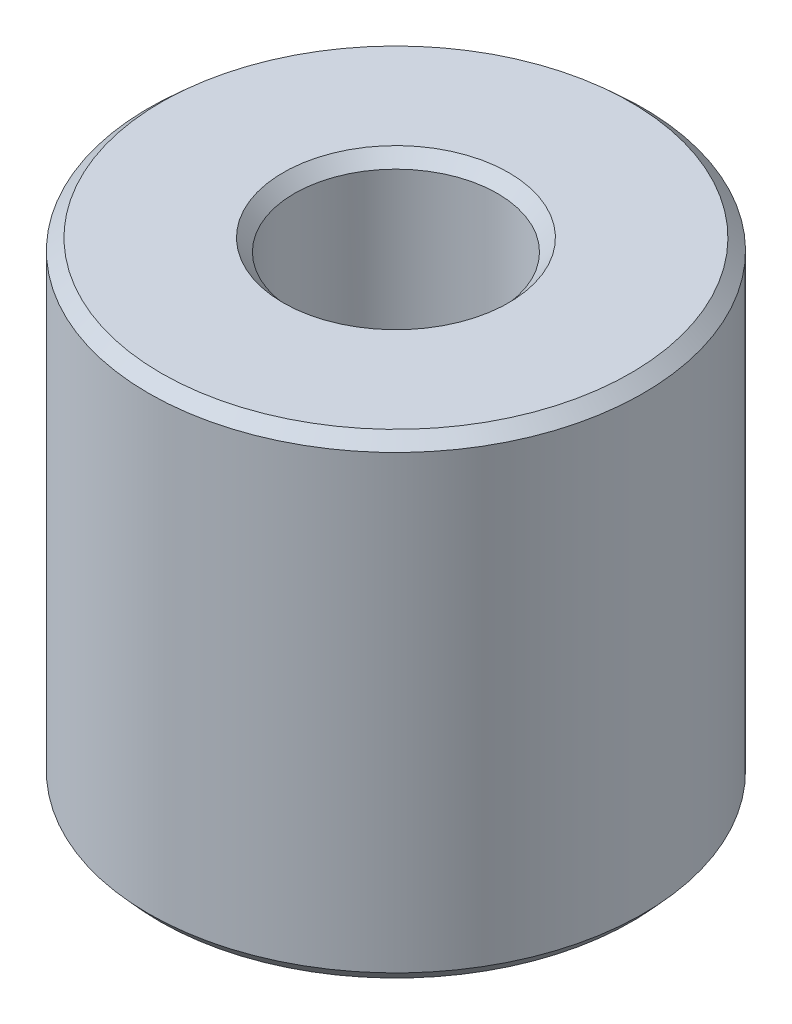
ISO-10303-21;
HEADER;
FILE_DESCRIPTION(('STEP AP214'),'2;1');
FILE_NAME('part.step','',(''),(''),'','','');
FILE_SCHEMA(('AUTOMOTIVE_DESIGN { 1 0 10303 214 1 1 1 1 }'));
ENDSEC;
DATA;
#1=APPLICATION_CONTEXT('core data for automotive mechanical design processes');
#2=APPLICATION_PROTOCOL_DEFINITION('international standard','automotive_design',2000,#1);
#3=PRODUCT_CONTEXT('',#1,'mechanical');
#4=PRODUCT('Part','Part','',(#3));
#5=PRODUCT_RELATED_PRODUCT_CATEGORY('part','',(#4));
#6=PRODUCT_DEFINITION_FORMATION('','',#4);
#7=PRODUCT_DEFINITION_CONTEXT('part definition',#1,'design');
#8=PRODUCT_DEFINITION('design','',#6,#7);
#9=PRODUCT_DEFINITION_SHAPE('','',#8);
#10=(LENGTH_UNIT() NAMED_UNIT(*) SI_UNIT(.MILLI.,.METRE.));
#11=(NAMED_UNIT(*) PLANE_ANGLE_UNIT() SI_UNIT($,.RADIAN.));
#12=(NAMED_UNIT(*) SI_UNIT($,.STERADIAN.) SOLID_ANGLE_UNIT());
#13=UNCERTAINTY_MEASURE_WITH_UNIT(LENGTH_MEASURE(1.E-05),#10,'distance_accuracy_value','');
#14=(GEOMETRIC_REPRESENTATION_CONTEXT(3) GLOBAL_UNCERTAINTY_ASSIGNED_CONTEXT((#13)) GLOBAL_UNIT_ASSIGNED_CONTEXT((#10,
#11,#12)) REPRESENTATION_CONTEXT('',''));
#15=CARTESIAN_POINT('',(0.,0.,0.));
#16=DIRECTION('',(0.,0.,1.));
#17=DIRECTION('',(1.,0.,0.));
#18=AXIS2_PLACEMENT_3D('',#15,#16,#17);
#19=CARTESIAN_POINT('',(0.,110.350583465729,0.));
#20=DIRECTION('',(0.,-1.,0.));
#21=DIRECTION('',(0.,0.,-1.));
#22=AXIS2_PLACEMENT_3D('',#19,#20,#21);
#23=CYLINDRICAL_SURFACE('',#22,57.5);
#24=CARTESIAN_POINT('',(0.,2.88990004348269,0.));
#25=DIRECTION('',(0.,1.,0.));
#26=DIRECTION('',(0.,0.,1.));
#27=AXIS2_PLACEMENT_3D('',#24,#25,#26);
#28=CIRCLE('',#27,57.5);
#29=CARTESIAN_POINT('',(0.,2.88990004348269,57.5));
#30=VERTEX_POINT('',#29);
#31=EDGE_CURVE('E10',#30,#30,#28,.T.);
#32=ORIENTED_EDGE('',*,*,#31,.T.);
#33=EDGE_LOOP('',(#32));
#34=FACE_BOUND('',#33,.T.);
#35=CARTESIAN_POINT('',(0.,107.729197914453,0.));
#36=DIRECTION('',(0.,1.,0.));
#37=DIRECTION('',(0.,0.,1.));
#38=AXIS2_PLACEMENT_3D('',#35,#36,#37);
#39=CIRCLE('',#38,57.5);
#40=CARTESIAN_POINT('',(0.,107.729197914453,57.5));
#41=VERTEX_POINT('',#40);
#42=EDGE_CURVE('E50',#41,#41,#39,.F.);
#43=ORIENTED_EDGE('',*,*,#42,.T.);
#44=EDGE_LOOP('',(#43));
#45=FACE_BOUND('',#44,.T.);
#46=ADVANCED_FACE('F39',(#34,#45),#23,.T.);
#47=CARTESIAN_POINT('',(0.,110.350583465729,0.));
#48=DIRECTION('',(0.,1.,0.));
#49=DIRECTION('',(0.,0.,1.));
#50=AXIS2_PLACEMENT_3D('',#47,#48,#49);
#51=PLANE('',#50);
#52=CARTESIAN_POINT('',(0.,110.350583465729,0.));
#53=DIRECTION('',(0.,1.,0.));
#54=DIRECTION('',(0.,0.,1.));
#55=AXIS2_PLACEMENT_3D('',#52,#53,#54);
#56=CIRCLE('',#55,26.2375883471328);
#57=CARTESIAN_POINT('',(0.,110.350583465729,26.2375883471328));
#58=VERTEX_POINT('',#57);
#59=EDGE_CURVE('E58',#58,#58,#56,.F.);
#60=ORIENTED_EDGE('',*,*,#59,.T.);
#61=EDGE_LOOP('',(#60));
#62=FACE_BOUND('',#61,.T.);
#63=CARTESIAN_POINT('',(0.,110.350583465729,0.));
#64=DIRECTION('',(0.,1.,0.));
#65=DIRECTION('',(0.,0.,1.));
#66=AXIS2_PLACEMENT_3D('',#63,#64,#65);
#67=CIRCLE('',#66,54.6100999565173);
#68=CARTESIAN_POINT('',(0.,110.350583465729,54.6100999565173));
#69=VERTEX_POINT('',#68);
#70=EDGE_CURVE('E61',#69,#69,#67,.T.);
#71=ORIENTED_EDGE('',*,*,#70,.T.);
#72=EDGE_LOOP('',(#71));
#73=FACE_BOUND('',#72,.T.);
#74=ADVANCED_FACE('F88',(#62,#73),#51,.T.);
#75=CARTESIAN_POINT('',(0.,0.,0.));
#76=DIRECTION('',(0.,1.,0.));
#77=DIRECTION('',(0.,0.,1.));
#78=AXIS2_PLACEMENT_3D('',#75,#76,#77);
#79=PLANE('',#78);
#80=CARTESIAN_POINT('',(0.,0.,0.));
#81=DIRECTION('',(0.,1.,0.));
#82=DIRECTION('',(0.,0.,1.));
#83=AXIS2_PLACEMENT_3D('',#80,#81,#82);
#84=CIRCLE('',#83,26.506102839339);
#85=CARTESIAN_POINT('',(0.,0.,-26.506102839339));
#86=VERTEX_POINT('',#85);
#87=EDGE_CURVE('E51',#86,#86,#84,.T.);
#88=ORIENTED_EDGE('',*,*,#87,.T.);
#89=EDGE_LOOP('',(#88));
#90=FACE_BOUND('',#89,.T.);
#91=CARTESIAN_POINT('',(0.,0.,0.));
#92=DIRECTION('',(0.,1.,0.));
#93=DIRECTION('',(0.,0.,1.));
#94=AXIS2_PLACEMENT_3D('',#91,#92,#93);
#95=CIRCLE('',#94,54.8786144487235);
#96=CARTESIAN_POINT('',(0.,0.,54.8786144487235));
#97=VERTEX_POINT('',#96);
#98=EDGE_CURVE('E54',#97,#97,#95,.F.);
#99=ORIENTED_EDGE('',*,*,#98,.T.);
#100=EDGE_LOOP('',(#99));
#101=FACE_BOUND('',#100,.T.);
#102=ADVANCED_FACE('F83',(#90,#101),#79,.F.);
#103=CARTESIAN_POINT('',(0.,110.350583465729,0.));
#104=DIRECTION('',(0.,-1.,0.));
#105=DIRECTION('',(0.,0.,-1.));
#106=AXIS2_PLACEMENT_3D('',#103,#104,#105);
#107=CYLINDRICAL_SURFACE('',#106,23.6162027958563);
#108=CARTESIAN_POINT('',(0.,107.460683422247,0.));
#109=DIRECTION('',(0.,1.,0.));
#110=DIRECTION('',(0.,0.,1.));
#111=AXIS2_PLACEMENT_3D('',#108,#109,#110);
#112=CIRCLE('',#111,23.6162027958563);
#113=CARTESIAN_POINT('',(0.,107.460683422247,23.6162027958563));
#114=VERTEX_POINT('',#113);
#115=EDGE_CURVE('E67',#114,#114,#112,.T.);
#116=ORIENTED_EDGE('',*,*,#115,.T.);
#117=EDGE_LOOP('',(#116));
#118=FACE_BOUND('',#117,.T.);
#119=CARTESIAN_POINT('',(0.,2.62138555127651,0.));
#120=DIRECTION('',(0.,1.,0.));
#121=DIRECTION('',(0.,0.,1.));
#122=AXIS2_PLACEMENT_3D('',#119,#120,#121);
#123=CIRCLE('',#122,23.6162027958563);
#124=CARTESIAN_POINT('',(0.,2.62138555127651,-23.6162027958563));
#125=VERTEX_POINT('',#124);
#126=EDGE_CURVE('E69',#125,#125,#123,.F.);
#127=ORIENTED_EDGE('',*,*,#126,.T.);
#128=EDGE_LOOP('',(#127));
#129=FACE_BOUND('',#128,.T.);
#130=ADVANCED_FACE('F71',(#118,#129),#107,.F.);
#131=CARTESIAN_POINT('',(0.,107.460683422247,0.));
#132=DIRECTION('',(0.,1.,0.));
#133=DIRECTION('',(0.,0.,1.));
#134=AXIS2_PLACEMENT_3D('',#131,#132,#133);
#135=CONICAL_SURFACE('',#134,23.6162027958563,0.736715813299954);
#136=ORIENTED_EDGE('',*,*,#59,.F.);
#137=EDGE_LOOP('',(#136));
#138=FACE_BOUND('',#137,.T.);
#139=ORIENTED_EDGE('',*,*,#115,.F.);
#140=EDGE_LOOP('',(#139));
#141=FACE_BOUND('',#140,.T.);
#142=ADVANCED_FACE('F77',(#138,#141),#135,.F.);
#143=CARTESIAN_POINT('',(0.,0.,0.));
#144=DIRECTION('',(0.,-1.,0.));
#145=DIRECTION('',(0.,0.,-1.));
#146=AXIS2_PLACEMENT_3D('',#143,#144,#145);
#147=CONICAL_SURFACE('',#146,26.506102839339,0.834080513494946);
#148=CARTESIAN_POINT('',(0.,2.62138555127651,-23.6162027958563));
#149=CARTESIAN_POINT('',(0.,2.59407945178405,-23.6463059213092));
#150=CARTESIAN_POINT('',(0.,2.56677335229159,-23.6764090467621));
#151=CARTESIAN_POINT('',(0.,2.51216115330666,-23.736615297668));
#152=CARTESIAN_POINT('',(0.,2.48485505381419,-23.766718423121));
#153=CARTESIAN_POINT('',(0.,2.43024285482927,-23.8269246740269));
#154=CARTESIAN_POINT('',(0.,2.4029367553368,-23.8570277994798));
#155=CARTESIAN_POINT('',(0.,2.34832455635188,-23.9172340503857));
#156=CARTESIAN_POINT('',(0.,2.32101845685941,-23.9473371758386));
#157=CARTESIAN_POINT('',(0.,2.26640625787449,-24.0075434267445));
#158=CARTESIAN_POINT('',(0.,2.23910015838202,-24.0376465521975));
#159=CARTESIAN_POINT('',(0.,2.18448795939709,-24.0978528031034));
#160=CARTESIAN_POINT('',(0.,2.15718185990463,-24.1279559285563));
#161=CARTESIAN_POINT('',(0.,2.1025696609197,-24.1881621794622));
#162=CARTESIAN_POINT('',(0.,2.07526356142724,-24.2182653049151));
#163=CARTESIAN_POINT('',(0.,2.02065136244231,-24.278471555821));
#164=CARTESIAN_POINT('',(0.,1.99334526294985,-24.308574681274));
#165=CARTESIAN_POINT('',(0.,1.93873306396492,-24.3687809321799));
#166=CARTESIAN_POINT('',(0.,1.91142696447246,-24.3988840576328));
#167=CARTESIAN_POINT('',(0.,1.85681476548753,-24.4590903085387));
#168=CARTESIAN_POINT('',(0.,1.82950866599507,-24.4891934339917));
#169=CARTESIAN_POINT('',(0.,1.77489646701014,-24.5493996848975));
#170=CARTESIAN_POINT('',(0.,1.74759036751768,-24.5795028103505));
#171=CARTESIAN_POINT('',(0.,1.69297816853275,-24.6397090612564));
#172=CARTESIAN_POINT('',(0.,1.66567206904029,-24.6698121867093));
#173=CARTESIAN_POINT('',(0.,1.61105987005536,-24.7300184376152));
#174=CARTESIAN_POINT('',(0.,1.58375377056289,-24.7601215630682));
#175=CARTESIAN_POINT('',(0.,1.52914157157797,-24.820327813974));
#176=CARTESIAN_POINT('',(0.,1.5018354720855,-24.850430939427));
#177=CARTESIAN_POINT('',(0.,1.44722327310058,-24.9106371903329));
#178=CARTESIAN_POINT('',(0.,1.41991717360811,-24.9407403157858));
#179=CARTESIAN_POINT('',(0.,1.36530497462318,-25.0009465666917));
#180=CARTESIAN_POINT('',(0.,1.33799887513072,-25.0310496921447));
#181=CARTESIAN_POINT('',(0.,1.28338667614579,-25.0912559430505));
#182=CARTESIAN_POINT('',(0.,1.25608057665333,-25.1213590685035));
#183=CARTESIAN_POINT('',(0.,1.2014683776684,-25.1815653194094));
#184=CARTESIAN_POINT('',(0.,1.17416227817594,-25.2116684448623));
#185=CARTESIAN_POINT('',(0.,1.11955007919101,-25.2718746957682));
#186=CARTESIAN_POINT('',(0.,1.09224397969855,-25.3019778212212));
#187=CARTESIAN_POINT('',(0.,1.03763178071362,-25.362184072127));
#188=CARTESIAN_POINT('',(0.,1.01032568122116,-25.39228719758));
#189=CARTESIAN_POINT('',(0.,0.955713482236229,-25.4524934484859));
#190=CARTESIAN_POINT('',(0.,0.928407382743766,-25.4825965739388));
#191=CARTESIAN_POINT('',(0.,0.873795183758838,-25.5428028248447));
#192=CARTESIAN_POINT('',(0.,0.846489084266374,-25.5729059502977));
#193=CARTESIAN_POINT('',(0.,0.791876885281447,-25.6331122012035));
#194=CARTESIAN_POINT('',(0.,0.764570785788983,-25.6632153266565));
#195=CARTESIAN_POINT('',(0.,0.709958586804056,-25.7234215775624));
#196=CARTESIAN_POINT('',(0.,0.682652487311592,-25.7535247030153));
#197=CARTESIAN_POINT('',(0.,0.628040288326665,-25.8137309539212));
#198=CARTESIAN_POINT('',(0.,0.600734188834201,-25.8438340793742));
#199=CARTESIAN_POINT('',(0.,0.546121989849274,-25.9040403302801));
#200=CARTESIAN_POINT('',(0.,0.51881589035681,-25.934143455733));
#201=CARTESIAN_POINT('',(0.,0.464203691371882,-25.9943497066389));
#202=CARTESIAN_POINT('',(0.,0.436897591879419,-26.0244528320918));
#203=CARTESIAN_POINT('',(0.,0.382285392894491,-26.0846590829977));
#204=CARTESIAN_POINT('',(0.,0.354979293402028,-26.1147622084507));
#205=CARTESIAN_POINT('',(0.,0.300367094417101,-26.1749684593566));
#206=CARTESIAN_POINT('',(0.,0.273060994924637,-26.2050715848095));
#207=CARTESIAN_POINT('',(0.,0.218448795939709,-26.2652778357154));
#208=CARTESIAN_POINT('',(0.,0.191142696447245,-26.2953809611683));
#209=CARTESIAN_POINT('',(0.,0.136530497462318,-26.3555872120742));
#210=CARTESIAN_POINT('',(0.,0.109224397969855,-26.3856903375272));
#211=CARTESIAN_POINT('',(0.,0.0546121989849279,-26.4458965884331));
#212=CARTESIAN_POINT('',(0.,0.0273060994924645,-26.475999713886));
#213=CARTESIAN_POINT('',(0.,0.,-26.506102839339));
#214=B_SPLINE_CURVE_WITH_KNOTS('',3,(#148,#149,#150,#151,#152,#153,#154,#155,#156,#157,#158,
#159,#160,#161,#162,#163,#164,#165,#166,#167,#168,#169,#170,#171,#172,#173,#174,#175,#176,#177,
#178,#179,#180,#181,#182,#183,#184,#185,#186,#187,#188,#189,#190,#191,#192,#193,#194,#195,#196,
#197,#198,#199,#200,#201,#202,#203,#204,#205,#206,#207,#208,#209,#210,#211,#212,#213),
.UNSPECIFIED.,.F.,.F.,(4,2,2,2,2,2,2,2,2,2,2,2,2,2,2,2,2,2,2,2,2,2,2,2,2,2,2,2,2,2,2,2,4),(0.,
0.121927810952843,0.243855621905687,0.365783432858533,0.487711243811376,0.609639054764219,
0.731566865717065,0.853494676669909,0.975422487622752,1.0973502985756,1.21927810952844,
1.34120592048128,1.46313373143413,1.58506154238697,1.70698935333982,1.82891716429266,
1.95084497524551,2.07277278619835,2.1947005971512,2.31662840810404,2.43855621905688,
2.56048403000973,2.68241184096257,2.80433965191542,2.92626746286826,3.04819527382111,
3.17012308477395,3.29205089572679,3.41397870667964,3.53590651763248,3.65783432858533,
3.77976213953817,3.90168995049102),.UNSPECIFIED.);
#215=EDGE_CURVE('BSEAM73',#125,#86,#214,.T.);
#216=ORIENTED_EDGE('',*,*,#126,.F.);
#217=ORIENTED_EDGE('',*,*,#87,.F.);
#218=ORIENTED_EDGE('',*,*,#215,.T.);
#219=ORIENTED_EDGE('',*,*,#215,.F.);
#220=EDGE_LOOP('',(#216,#218,#217,#219));
#221=FACE_BOUND('',#220,.T.);
#222=ADVANCED_FACE('F73',(#221),#147,.F.);
#223=CARTESIAN_POINT('',(0.,2.88990004348269,0.));
#224=DIRECTION('',(0.,1.,0.));
#225=DIRECTION('',(0.,0.,1.));
#226=AXIS2_PLACEMENT_3D('',#223,#224,#225);
#227=CONICAL_SURFACE('',#226,57.5,0.736715813299951);
#228=ORIENTED_EDGE('',*,*,#98,.F.);
#229=EDGE_LOOP('',(#228));
#230=FACE_BOUND('',#229,.T.);
#231=ORIENTED_EDGE('',*,*,#31,.F.);
#232=EDGE_LOOP('',(#231));
#233=FACE_BOUND('',#232,.T.);
#234=ADVANCED_FACE('F76',(#230,#233),#227,.T.);
#235=CARTESIAN_POINT('',(0.,110.350583465729,0.));
#236=DIRECTION('',(0.,-1.,0.));
#237=DIRECTION('',(0.,0.,-1.));
#238=AXIS2_PLACEMENT_3D('',#235,#236,#237);
#239=CONICAL_SURFACE('',#238,54.6100999565173,0.834080513494949);
#240=ORIENTED_EDGE('',*,*,#42,.F.);
#241=EDGE_LOOP('',(#240));
#242=FACE_BOUND('',#241,.T.);
#243=ORIENTED_EDGE('',*,*,#70,.F.);
#244=EDGE_LOOP('',(#243));
#245=FACE_BOUND('',#244,.T.);
#246=ADVANCED_FACE('F45',(#242,#245),#239,.T.);
#247=CLOSED_SHELL('',(#46,#74,#102,#130,#142,#222,#234,#246));
#248=MANIFOLD_SOLID_BREP('B2',#247);
#249=ADVANCED_BREP_SHAPE_REPRESENTATION('',(#18,#248),#14);
#250=SHAPE_DEFINITION_REPRESENTATION(#9,#249);
ENDSEC;
END-ISO-10303-21;
